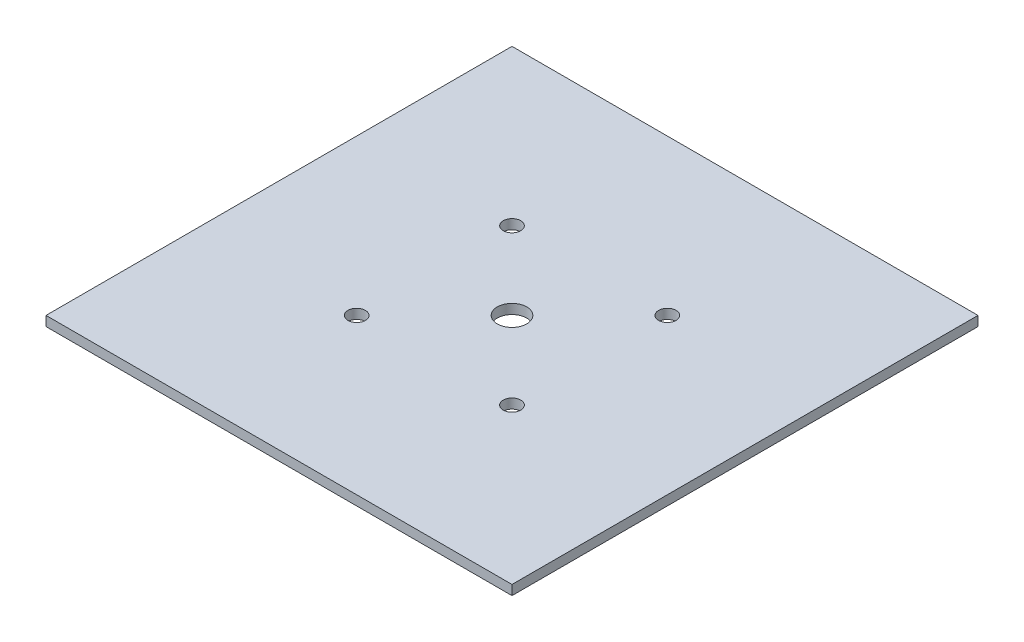
ISO-10303-21;
HEADER;
FILE_DESCRIPTION(('STEP AP214'),'2;1');
FILE_NAME('part.step','',(''),(''),'','','');
FILE_SCHEMA(('AUTOMOTIVE_DESIGN { 1 0 10303 214 1 1 1 1 }'));
ENDSEC;
DATA;
#1=APPLICATION_CONTEXT('core data for automotive mechanical design processes');
#2=APPLICATION_PROTOCOL_DEFINITION('international standard','automotive_design',2000,#1);
#3=PRODUCT_CONTEXT('',#1,'mechanical');
#4=PRODUCT('Part','Part','',(#3));
#5=PRODUCT_RELATED_PRODUCT_CATEGORY('part','',(#4));
#6=PRODUCT_DEFINITION_FORMATION('','',#4);
#7=PRODUCT_DEFINITION_CONTEXT('part definition',#1,'design');
#8=PRODUCT_DEFINITION('design','',#6,#7);
#9=PRODUCT_DEFINITION_SHAPE('','',#8);
#10=(LENGTH_UNIT() NAMED_UNIT(*) SI_UNIT(.MILLI.,.METRE.));
#11=(NAMED_UNIT(*) PLANE_ANGLE_UNIT() SI_UNIT($,.RADIAN.));
#12=(NAMED_UNIT(*) SI_UNIT($,.STERADIAN.) SOLID_ANGLE_UNIT());
#13=UNCERTAINTY_MEASURE_WITH_UNIT(LENGTH_MEASURE(1.E-05),#10,'distance_accuracy_value','');
#14=(GEOMETRIC_REPRESENTATION_CONTEXT(3) GLOBAL_UNCERTAINTY_ASSIGNED_CONTEXT((#13)) GLOBAL_UNIT_ASSIGNED_CONTEXT((#10,
#11,#12)) REPRESENTATION_CONTEXT('',''));
#15=CARTESIAN_POINT('',(0.,0.,0.));
#16=DIRECTION('',(0.,0.,1.));
#17=DIRECTION('',(1.,0.,0.));
#18=AXIS2_PLACEMENT_3D('',#15,#16,#17);
#19=CARTESIAN_POINT('',(-76.2,1.58749999999999,76.2));
#20=DIRECTION('',(1.,0.,0.));
#21=DIRECTION('',(0.,0.,-1.));
#22=AXIS2_PLACEMENT_3D('',#19,#20,#21);
#23=PLANE('',#22);
#24=DIRECTION('',(0.,-1.,0.));
#25=VECTOR('',#24,1.);
#26=CARTESIAN_POINT('',(-76.2,1.58749999999999,-76.2));
#27=LINE('',#26,#25);
#28=CARTESIAN_POINT('',(-76.2,1.58749999999999,-76.2));
#29=VERTEX_POINT('',#28);
#30=CARTESIAN_POINT('',(-76.2,-1.58750000000001,-76.2));
#31=VERTEX_POINT('',#30);
#32=EDGE_CURVE('E95',#29,#31,#27,.T.);
#33=ORIENTED_EDGE('',*,*,#32,.T.);
#34=DIRECTION('',(0.,0.,-1.));
#35=VECTOR('',#34,1.);
#36=CARTESIAN_POINT('',(-76.2,-1.58750000000001,76.2));
#37=LINE('',#36,#35);
#38=CARTESIAN_POINT('',(-76.2,-1.58750000000001,76.2));
#39=VERTEX_POINT('',#38);
#40=EDGE_CURVE('E11',#39,#31,#37,.T.);
#41=ORIENTED_EDGE('',*,*,#40,.F.);
#42=DIRECTION('',(0.,-1.,0.));
#43=VECTOR('',#42,1.);
#44=CARTESIAN_POINT('',(-76.2,1.58749999999999,76.2));
#45=LINE('',#44,#43);
#46=CARTESIAN_POINT('',(-76.2,1.58749999999999,76.2));
#47=VERTEX_POINT('',#46);
#48=EDGE_CURVE('E83',#47,#39,#45,.T.);
#49=ORIENTED_EDGE('',*,*,#48,.F.);
#50=DIRECTION('',(0.,0.,-1.));
#51=VECTOR('',#50,1.);
#52=CARTESIAN_POINT('',(-76.2,1.58749999999999,76.2));
#53=LINE('',#52,#51);
#54=EDGE_CURVE('E91',#47,#29,#53,.T.);
#55=ORIENTED_EDGE('',*,*,#54,.T.);
#56=EDGE_LOOP('',(#33,#41,#49,#55));
#57=FACE_BOUND('',#56,.T.);
#58=ADVANCED_FACE('F32',(#57),#23,.F.);
#59=CARTESIAN_POINT('',(76.2,-1.58749999999999,76.2));
#60=DIRECTION('',(0.,1.,0.));
#61=DIRECTION('',(-1.,0.,0.));
#62=AXIS2_PLACEMENT_3D('',#59,#60,#61);
#63=PLANE('',#62);
#64=CARTESIAN_POINT('',(-25.4,-1.58750000000002,-25.4));
#65=DIRECTION('',(0.,1.,0.));
#66=DIRECTION('',(-1.,0.,0.));
#67=AXIS2_PLACEMENT_3D('',#64,#65,#66);
#68=CIRCLE('',#67,2.8575);
#69=CARTESIAN_POINT('',(-28.2575,-1.58750000000002,-25.4));
#70=VERTEX_POINT('',#69);
#71=EDGE_CURVE('E112',#70,#70,#68,.T.);
#72=ORIENTED_EDGE('',*,*,#71,.T.);
#73=EDGE_LOOP('',(#72));
#74=FACE_BOUND('',#73,.T.);
#75=CARTESIAN_POINT('',(25.4,-1.58750000000001,25.4));
#76=DIRECTION('',(0.,1.,0.));
#77=DIRECTION('',(-1.,0.,0.));
#78=AXIS2_PLACEMENT_3D('',#75,#76,#77);
#79=CIRCLE('',#78,2.8575);
#80=CARTESIAN_POINT('',(22.5425,-1.58750000000001,25.4));
#81=VERTEX_POINT('',#80);
#82=EDGE_CURVE('E118',#81,#81,#79,.T.);
#83=ORIENTED_EDGE('',*,*,#82,.T.);
#84=EDGE_LOOP('',(#83));
#85=FACE_BOUND('',#84,.T.);
#86=CARTESIAN_POINT('',(25.4,-1.58750000000001,-25.4));
#87=DIRECTION('',(0.,1.,0.));
#88=DIRECTION('',(-1.,0.,0.));
#89=AXIS2_PLACEMENT_3D('',#86,#87,#88);
#90=CIRCLE('',#89,2.8575);
#91=CARTESIAN_POINT('',(22.5425,-1.58750000000001,-25.4));
#92=VERTEX_POINT('',#91);
#93=EDGE_CURVE('E119',#92,#92,#90,.T.);
#94=ORIENTED_EDGE('',*,*,#93,.T.);
#95=EDGE_LOOP('',(#94));
#96=FACE_BOUND('',#95,.T.);
#97=CARTESIAN_POINT('',(0.,-1.58750000000002,0.));
#98=DIRECTION('',(0.,1.,0.));
#99=DIRECTION('',(-1.,0.,0.));
#100=AXIS2_PLACEMENT_3D('',#97,#98,#99);
#101=CIRCLE('',#100,4.826);
#102=CARTESIAN_POINT('',(-4.826,-1.58750000000002,0.));
#103=VERTEX_POINT('',#102);
#104=EDGE_CURVE('E130',#103,#103,#101,.T.);
#105=ORIENTED_EDGE('',*,*,#104,.T.);
#106=EDGE_LOOP('',(#105));
#107=FACE_BOUND('',#106,.T.);
#108=CARTESIAN_POINT('',(-25.4,-1.58750000000002,25.4));
#109=DIRECTION('',(0.,1.,0.));
#110=DIRECTION('',(-1.,0.,0.));
#111=AXIS2_PLACEMENT_3D('',#108,#109,#110);
#112=CIRCLE('',#111,2.8575);
#113=CARTESIAN_POINT('',(-28.2575,-1.58750000000002,25.4));
#114=VERTEX_POINT('',#113);
#115=EDGE_CURVE('E98',#114,#114,#112,.T.);
#116=ORIENTED_EDGE('',*,*,#115,.T.);
#117=EDGE_LOOP('',(#116));
#118=FACE_BOUND('',#117,.T.);
#119=DIRECTION('',(1.,0.,0.));
#120=VECTOR('',#119,1.);
#121=CARTESIAN_POINT('',(76.2,-1.58749999999999,-76.2));
#122=LINE('',#121,#120);
#123=CARTESIAN_POINT('',(76.2,-1.58749999999999,-76.2));
#124=VERTEX_POINT('',#123);
#125=EDGE_CURVE('E87',#31,#124,#122,.T.);
#126=ORIENTED_EDGE('',*,*,#125,.T.);
#127=DIRECTION('',(0.,0.,-1.));
#128=VECTOR('',#127,1.);
#129=CARTESIAN_POINT('',(76.2,-1.58749999999999,76.2));
#130=LINE('',#129,#128);
#131=CARTESIAN_POINT('',(76.2,-1.58749999999999,76.2));
#132=VERTEX_POINT('',#131);
#133=EDGE_CURVE('E40',#132,#124,#130,.T.);
#134=ORIENTED_EDGE('',*,*,#133,.F.);
#135=DIRECTION('',(1.,0.,0.));
#136=VECTOR('',#135,1.);
#137=CARTESIAN_POINT('',(76.2,-1.58749999999999,76.2));
#138=LINE('',#137,#136);
#139=EDGE_CURVE('E78',#39,#132,#138,.T.);
#140=ORIENTED_EDGE('',*,*,#139,.F.);
#141=ORIENTED_EDGE('',*,*,#40,.T.);
#142=EDGE_LOOP('',(#126,#134,#140,#141));
#143=FACE_BOUND('',#142,.T.);
#144=ADVANCED_FACE('F86',(#74,#85,#96,#107,#118,#143),#63,.F.);
#145=CARTESIAN_POINT('',(76.2,1.58750000000001,76.2));
#146=DIRECTION('',(-1.,0.,0.));
#147=DIRECTION('',(0.,0.,1.));
#148=AXIS2_PLACEMENT_3D('',#145,#146,#147);
#149=PLANE('',#148);
#150=DIRECTION('',(0.,1.,0.));
#151=VECTOR('',#150,1.);
#152=CARTESIAN_POINT('',(76.2,1.58750000000001,-76.2));
#153=LINE('',#152,#151);
#154=CARTESIAN_POINT('',(76.2,1.58750000000001,-76.2));
#155=VERTEX_POINT('',#154);
#156=EDGE_CURVE('E65',#124,#155,#153,.T.);
#157=ORIENTED_EDGE('',*,*,#156,.T.);
#158=DIRECTION('',(0.,0.,-1.));
#159=VECTOR('',#158,1.);
#160=CARTESIAN_POINT('',(76.2,1.58750000000001,76.2));
#161=LINE('',#160,#159);
#162=CARTESIAN_POINT('',(76.2,1.58750000000001,76.2));
#163=VERTEX_POINT('',#162);
#164=EDGE_CURVE('E88',#163,#155,#161,.T.);
#165=ORIENTED_EDGE('',*,*,#164,.F.);
#166=DIRECTION('',(0.,1.,0.));
#167=VECTOR('',#166,1.);
#168=CARTESIAN_POINT('',(76.2,1.58750000000001,76.2));
#169=LINE('',#168,#167);
#170=EDGE_CURVE('E81',#132,#163,#169,.T.);
#171=ORIENTED_EDGE('',*,*,#170,.F.);
#172=ORIENTED_EDGE('',*,*,#133,.T.);
#173=EDGE_LOOP('',(#157,#165,#171,#172));
#174=FACE_BOUND('',#173,.T.);
#175=ADVANCED_FACE('F89',(#174),#149,.F.);
#176=CARTESIAN_POINT('',(76.2,1.58750000000001,76.2));
#177=DIRECTION('',(0.,-1.,0.));
#178=DIRECTION('',(1.,0.,0.));
#179=AXIS2_PLACEMENT_3D('',#176,#177,#178);
#180=PLANE('',#179);
#181=CARTESIAN_POINT('',(-25.4,1.5875,-25.4));
#182=DIRECTION('',(0.,1.,0.));
#183=DIRECTION('',(-1.,0.,0.));
#184=AXIS2_PLACEMENT_3D('',#181,#182,#183);
#185=CIRCLE('',#184,2.8575);
#186=CARTESIAN_POINT('',(-28.2575,1.5875,-25.4));
#187=VERTEX_POINT('',#186);
#188=EDGE_CURVE('E122',#187,#187,#185,.T.);
#189=ORIENTED_EDGE('',*,*,#188,.F.);
#190=EDGE_LOOP('',(#189));
#191=FACE_BOUND('',#190,.T.);
#192=CARTESIAN_POINT('',(25.4,1.5875,25.4));
#193=DIRECTION('',(0.,1.,0.));
#194=DIRECTION('',(-1.,0.,0.));
#195=AXIS2_PLACEMENT_3D('',#192,#193,#194);
#196=CIRCLE('',#195,2.8575);
#197=CARTESIAN_POINT('',(22.5425,1.5875,25.4));
#198=VERTEX_POINT('',#197);
#199=EDGE_CURVE('E115',#198,#198,#196,.T.);
#200=ORIENTED_EDGE('',*,*,#199,.F.);
#201=EDGE_LOOP('',(#200));
#202=FACE_BOUND('',#201,.T.);
#203=CARTESIAN_POINT('',(25.4,1.5875,-25.4));
#204=DIRECTION('',(0.,1.,0.));
#205=DIRECTION('',(-1.,0.,0.));
#206=AXIS2_PLACEMENT_3D('',#203,#204,#205);
#207=CIRCLE('',#206,2.8575);
#208=CARTESIAN_POINT('',(22.5425,1.5875,-25.4));
#209=VERTEX_POINT('',#208);
#210=EDGE_CURVE('E133',#209,#209,#207,.T.);
#211=ORIENTED_EDGE('',*,*,#210,.F.);
#212=EDGE_LOOP('',(#211));
#213=FACE_BOUND('',#212,.T.);
#214=CARTESIAN_POINT('',(0.,1.5875,0.));
#215=DIRECTION('',(0.,1.,0.));
#216=DIRECTION('',(-1.,0.,0.));
#217=AXIS2_PLACEMENT_3D('',#214,#215,#216);
#218=CIRCLE('',#217,4.826);
#219=CARTESIAN_POINT('',(-4.826,1.5875,0.));
#220=VERTEX_POINT('',#219);
#221=EDGE_CURVE('E127',#220,#220,#218,.T.);
#222=ORIENTED_EDGE('',*,*,#221,.F.);
#223=EDGE_LOOP('',(#222));
#224=FACE_BOUND('',#223,.T.);
#225=CARTESIAN_POINT('',(-25.4,1.5875,25.4));
#226=DIRECTION('',(0.,1.,0.));
#227=DIRECTION('',(-1.,0.,0.));
#228=AXIS2_PLACEMENT_3D('',#225,#226,#227);
#229=CIRCLE('',#228,2.8575);
#230=CARTESIAN_POINT('',(-28.2575,1.5875,25.4));
#231=VERTEX_POINT('',#230);
#232=EDGE_CURVE('E109',#231,#231,#229,.T.);
#233=ORIENTED_EDGE('',*,*,#232,.F.);
#234=EDGE_LOOP('',(#233));
#235=FACE_BOUND('',#234,.T.);
#236=DIRECTION('',(-1.,0.,0.));
#237=VECTOR('',#236,1.);
#238=CARTESIAN_POINT('',(76.2,1.58750000000001,-76.2));
#239=LINE('',#238,#237);
#240=EDGE_CURVE('E71',#155,#29,#239,.T.);
#241=ORIENTED_EDGE('',*,*,#240,.T.);
#242=ORIENTED_EDGE('',*,*,#54,.F.);
#243=DIRECTION('',(-1.,0.,0.));
#244=VECTOR('',#243,1.);
#245=CARTESIAN_POINT('',(76.2,1.58750000000001,76.2));
#246=LINE('',#245,#244);
#247=EDGE_CURVE('E48',#163,#47,#246,.T.);
#248=ORIENTED_EDGE('',*,*,#247,.F.);
#249=ORIENTED_EDGE('',*,*,#164,.T.);
#250=EDGE_LOOP('',(#241,#242,#248,#249));
#251=FACE_BOUND('',#250,.T.);
#252=ADVANCED_FACE('F103',(#191,#202,#213,#224,#235,#251),#180,.F.);
#253=CARTESIAN_POINT('',(0.,0.,76.2));
#254=DIRECTION('',(0.,0.,-1.));
#255=DIRECTION('',(-1.,0.,0.));
#256=AXIS2_PLACEMENT_3D('',#253,#254,#255);
#257=PLANE('',#256);
#258=ORIENTED_EDGE('',*,*,#48,.T.);
#259=ORIENTED_EDGE('',*,*,#139,.T.);
#260=ORIENTED_EDGE('',*,*,#170,.T.);
#261=ORIENTED_EDGE('',*,*,#247,.T.);
#262=EDGE_LOOP('',(#258,#259,#260,#261));
#263=FACE_BOUND('',#262,.T.);
#264=ADVANCED_FACE('F79',(#263),#257,.F.);
#265=CARTESIAN_POINT('',(0.,0.,-76.2));
#266=DIRECTION('',(0.,0.,-1.));
#267=DIRECTION('',(-1.,0.,0.));
#268=AXIS2_PLACEMENT_3D('',#265,#266,#267);
#269=PLANE('',#268);
#270=ORIENTED_EDGE('',*,*,#32,.F.);
#271=ORIENTED_EDGE('',*,*,#240,.F.);
#272=ORIENTED_EDGE('',*,*,#156,.F.);
#273=ORIENTED_EDGE('',*,*,#125,.F.);
#274=EDGE_LOOP('',(#270,#271,#272,#273));
#275=FACE_BOUND('',#274,.T.);
#276=ADVANCED_FACE('F106',(#275),#269,.T.);
#277=CARTESIAN_POINT('',(-25.4,-1.58750000000002,25.4));
#278=DIRECTION('',(0.,1.,0.));
#279=DIRECTION('',(-1.,0.,0.));
#280=AXIS2_PLACEMENT_3D('',#277,#278,#279);
#281=CYLINDRICAL_SURFACE('',#280,2.8575);
#282=ORIENTED_EDGE('',*,*,#115,.F.);
#283=EDGE_LOOP('',(#282));
#284=FACE_BOUND('',#283,.T.);
#285=ORIENTED_EDGE('',*,*,#232,.T.);
#286=EDGE_LOOP('',(#285));
#287=FACE_BOUND('',#286,.T.);
#288=ADVANCED_FACE('F157',(#284,#287),#281,.F.);
#289=CARTESIAN_POINT('',(0.,-1.58750000000002,0.));
#290=DIRECTION('',(0.,1.,0.));
#291=DIRECTION('',(-1.,0.,0.));
#292=AXIS2_PLACEMENT_3D('',#289,#290,#291);
#293=CYLINDRICAL_SURFACE('',#292,4.826);
#294=ORIENTED_EDGE('',*,*,#104,.F.);
#295=EDGE_LOOP('',(#294));
#296=FACE_BOUND('',#295,.T.);
#297=ORIENTED_EDGE('',*,*,#221,.T.);
#298=EDGE_LOOP('',(#297));
#299=FACE_BOUND('',#298,.T.);
#300=ADVANCED_FACE('F145',(#296,#299),#293,.F.);
#301=CARTESIAN_POINT('',(25.4,-1.58750000000001,-25.4));
#302=DIRECTION('',(0.,1.,0.));
#303=DIRECTION('',(-1.,0.,0.));
#304=AXIS2_PLACEMENT_3D('',#301,#302,#303);
#305=CYLINDRICAL_SURFACE('',#304,2.8575);
#306=ORIENTED_EDGE('',*,*,#93,.F.);
#307=EDGE_LOOP('',(#306));
#308=FACE_BOUND('',#307,.T.);
#309=ORIENTED_EDGE('',*,*,#210,.T.);
#310=EDGE_LOOP('',(#309));
#311=FACE_BOUND('',#310,.T.);
#312=ADVANCED_FACE('F141',(#308,#311),#305,.F.);
#313=CARTESIAN_POINT('',(25.4,-1.58750000000001,25.4));
#314=DIRECTION('',(0.,1.,0.));
#315=DIRECTION('',(-1.,0.,0.));
#316=AXIS2_PLACEMENT_3D('',#313,#314,#315);
#317=CYLINDRICAL_SURFACE('',#316,2.8575);
#318=ORIENTED_EDGE('',*,*,#82,.F.);
#319=EDGE_LOOP('',(#318));
#320=FACE_BOUND('',#319,.T.);
#321=ORIENTED_EDGE('',*,*,#199,.T.);
#322=EDGE_LOOP('',(#321));
#323=FACE_BOUND('',#322,.T.);
#324=ADVANCED_FACE('F144',(#320,#323),#317,.F.);
#325=CARTESIAN_POINT('',(-25.4,-1.58750000000002,-25.4));
#326=DIRECTION('',(0.,1.,0.));
#327=DIRECTION('',(-1.,0.,0.));
#328=AXIS2_PLACEMENT_3D('',#325,#326,#327);
#329=CYLINDRICAL_SURFACE('',#328,2.8575);
#330=ORIENTED_EDGE('',*,*,#71,.F.);
#331=EDGE_LOOP('',(#330));
#332=FACE_BOUND('',#331,.T.);
#333=ORIENTED_EDGE('',*,*,#188,.T.);
#334=EDGE_LOOP('',(#333));
#335=FACE_BOUND('',#334,.T.);
#336=ADVANCED_FACE('F226',(#332,#335),#329,.F.);
#337=CLOSED_SHELL('',(#58,#144,#175,#252,#264,#276,#288,#300,#312,#324,#336));
#338=MANIFOLD_SOLID_BREP('B2',#337);
#339=ADVANCED_BREP_SHAPE_REPRESENTATION('',(#18,#338),#14);
#340=SHAPE_DEFINITION_REPRESENTATION(#9,#339);
ENDSEC;
END-ISO-10303-21;
